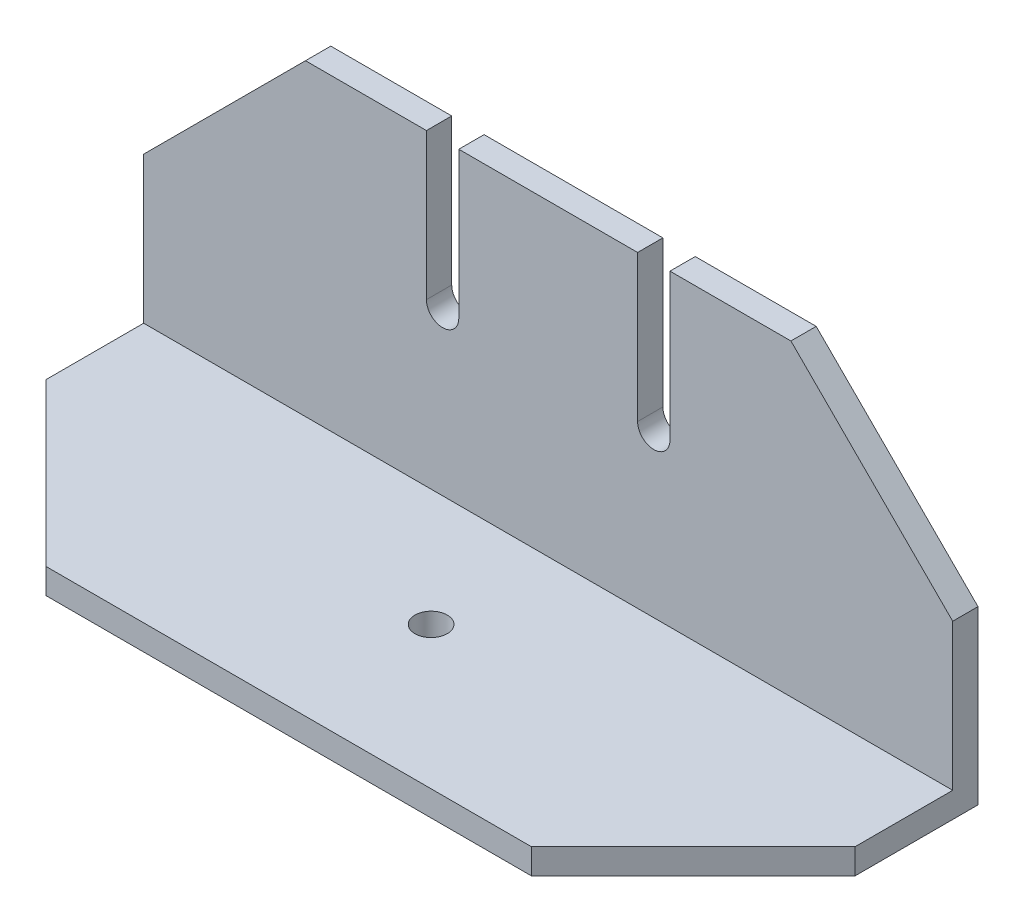
ISO-10303-21;
HEADER;
FILE_DESCRIPTION(('STEP AP214'),'2;1');
FILE_NAME('part.step','',(''),(''),'','','');
FILE_SCHEMA(('AUTOMOTIVE_DESIGN { 1 0 10303 214 1 1 1 1 }'));
ENDSEC;
DATA;
#1=APPLICATION_CONTEXT('core data for automotive mechanical design processes');
#2=APPLICATION_PROTOCOL_DEFINITION('international standard','automotive_design',2000,#1);
#3=PRODUCT_CONTEXT('',#1,'mechanical');
#4=PRODUCT('Part','Part','',(#3));
#5=PRODUCT_RELATED_PRODUCT_CATEGORY('part','',(#4));
#6=PRODUCT_DEFINITION_FORMATION('','',#4);
#7=PRODUCT_DEFINITION_CONTEXT('part definition',#1,'design');
#8=PRODUCT_DEFINITION('design','',#6,#7);
#9=PRODUCT_DEFINITION_SHAPE('','',#8);
#10=(LENGTH_UNIT() NAMED_UNIT(*) SI_UNIT(.MILLI.,.METRE.));
#11=(NAMED_UNIT(*) PLANE_ANGLE_UNIT() SI_UNIT($,.RADIAN.));
#12=(NAMED_UNIT(*) SI_UNIT($,.STERADIAN.) SOLID_ANGLE_UNIT());
#13=UNCERTAINTY_MEASURE_WITH_UNIT(LENGTH_MEASURE(1.E-05),#10,'distance_accuracy_value','');
#14=(GEOMETRIC_REPRESENTATION_CONTEXT(3) GLOBAL_UNCERTAINTY_ASSIGNED_CONTEXT((#13)) GLOBAL_UNIT_ASSIGNED_CONTEXT((#10,
#11,#12)) REPRESENTATION_CONTEXT('',''));
#15=CARTESIAN_POINT('',(0.,0.,0.));
#16=DIRECTION('',(0.,0.,1.));
#17=DIRECTION('',(1.,0.,0.));
#18=AXIS2_PLACEMENT_3D('',#15,#16,#17);
#19=CARTESIAN_POINT('',(100.,38.1,-32.0729965784261));
#20=DIRECTION('',(0.,1.,0.));
#21=DIRECTION('',(0.,0.,1.));
#22=AXIS2_PLACEMENT_3D('',#19,#20,#21);
#23=PLANE('',#22);
#24=DIRECTION('',(-1.,0.,0.));
#25=VECTOR('',#24,1.);
#26=CARTESIAN_POINT('',(100.,38.1,-32.0729965784261));
#27=LINE('',#26,#25);
#28=CARTESIAN_POINT('',(80.,38.1,-32.0729965784261));
#29=VERTEX_POINT('',#28);
#30=CARTESIAN_POINT('',(65.05,38.1,-32.0729965784261));
#31=VERTEX_POINT('',#30);
#32=EDGE_CURVE('E241',#29,#31,#27,.T.);
#33=ORIENTED_EDGE('',*,*,#32,.F.);
#34=DIRECTION('',(0.,0.,-1.));
#35=VECTOR('',#34,1.);
#36=CARTESIAN_POINT('',(80.,38.1,-35.1979965784261));
#37=LINE('',#36,#35);
#38=CARTESIAN_POINT('',(80.,38.1,-35.1979965784261));
#39=VERTEX_POINT('',#38);
#40=EDGE_CURVE('E273',#29,#39,#37,.T.);
#41=ORIENTED_EDGE('',*,*,#40,.T.);
#42=DIRECTION('',(-1.,0.,0.));
#43=VECTOR('',#42,1.);
#44=CARTESIAN_POINT('',(100.,38.1,-35.1979965784261));
#45=LINE('',#44,#43);
#46=CARTESIAN_POINT('',(65.05,38.1,-35.1979965784261));
#47=VERTEX_POINT('',#46);
#48=EDGE_CURVE('E245',#39,#47,#45,.T.);
#49=ORIENTED_EDGE('',*,*,#48,.T.);
#50=DIRECTION('',(0.,0.,-1.));
#51=VECTOR('',#50,1.);
#52=CARTESIAN_POINT('',(65.05,38.1,0.));
#53=LINE('',#52,#51);
#54=EDGE_CURVE('E190',#31,#47,#53,.T.);
#55=ORIENTED_EDGE('',*,*,#54,.F.);
#56=EDGE_LOOP('',(#33,#41,#49,#55));
#57=FACE_BOUND('',#56,.T.);
#58=ADVANCED_FACE('F32',(#57),#23,.T.);
#59=DIRECTION('',(0.,0.,-1.));
#60=VECTOR('',#59,1.);
#61=CARTESIAN_POINT('',(61.05,38.1,0.));
#62=LINE('',#61,#60);
#63=CARTESIAN_POINT('',(61.05,38.1,-32.0729965784261));
#64=VERTEX_POINT('',#63);
#65=CARTESIAN_POINT('',(61.05,38.1,-35.1979965784261));
#66=VERTEX_POINT('',#65);
#67=EDGE_CURVE('E167',#64,#66,#62,.T.);
#68=ORIENTED_EDGE('',*,*,#67,.T.);
#69=CARTESIAN_POINT('',(38.95,38.1,-35.1979965784261));
#70=VERTEX_POINT('',#69);
#71=EDGE_CURVE('E183',#66,#70,#45,.T.);
#72=ORIENTED_EDGE('',*,*,#71,.T.);
#73=DIRECTION('',(0.,0.,-1.));
#74=VECTOR('',#73,1.);
#75=CARTESIAN_POINT('',(38.95,38.1,0.));
#76=LINE('',#75,#74);
#77=CARTESIAN_POINT('',(38.95,38.1,-32.0729965784261));
#78=VERTEX_POINT('',#77);
#79=EDGE_CURVE('E205',#78,#70,#76,.T.);
#80=ORIENTED_EDGE('',*,*,#79,.F.);
#81=EDGE_CURVE('E244',#64,#78,#27,.T.);
#82=ORIENTED_EDGE('',*,*,#81,.F.);
#83=EDGE_LOOP('',(#68,#72,#80,#82));
#84=FACE_BOUND('',#83,.T.);
#85=ADVANCED_FACE('F334',(#84),#23,.T.);
#86=CARTESIAN_POINT('',(100.,0.,-35.1979965784261));
#87=DIRECTION('',(0.,0.,1.));
#88=DIRECTION('',(1.,0.,0.));
#89=AXIS2_PLACEMENT_3D('',#86,#87,#88);
#90=PLANE('',#89);
#91=DIRECTION('',(0.,1.,0.));
#92=VECTOR('',#91,1.);
#93=CARTESIAN_POINT('',(0.,0.,-35.1979965784261));
#94=LINE('',#93,#92);
#95=CARTESIAN_POINT('',(0.,-3.125,-35.1979965784261));
#96=VERTEX_POINT('',#95);
#97=CARTESIAN_POINT('',(0.,18.1,-35.1979965784261));
#98=VERTEX_POINT('',#97);
#99=EDGE_CURVE('E204',#96,#98,#94,.T.);
#100=ORIENTED_EDGE('',*,*,#99,.T.);
#101=DIRECTION('',(-0.707106781186549,-0.707106781186546,0.));
#102=VECTOR('',#101,1.);
#103=CARTESIAN_POINT('',(0.,18.1,-35.1979965784261));
#104=LINE('',#103,#102);
#105=CARTESIAN_POINT('',(20.0000000000001,38.1,-35.1979965784261));
#106=VERTEX_POINT('',#105);
#107=EDGE_CURVE('E265',#98,#106,#104,.F.);
#108=ORIENTED_EDGE('',*,*,#107,.T.);
#109=CARTESIAN_POINT('',(34.95,38.1,-35.1979965784261));
#110=VERTEX_POINT('',#109);
#111=EDGE_CURVE('E243',#110,#106,#45,.T.);
#112=ORIENTED_EDGE('',*,*,#111,.F.);
#113=DIRECTION('',(0.,1.,0.));
#114=VECTOR('',#113,1.);
#115=CARTESIAN_POINT('',(34.95,38.1,-35.1979965784261));
#116=LINE('',#115,#114);
#117=CARTESIAN_POINT('',(34.95,20.,-35.1979965784261));
#118=VERTEX_POINT('',#117);
#119=EDGE_CURVE('E196',#118,#110,#116,.T.);
#120=ORIENTED_EDGE('',*,*,#119,.F.);
#121=CARTESIAN_POINT('',(36.95,20.,-35.1979965784261));
#122=DIRECTION('',(0.,0.,-1.));
#123=DIRECTION('',(1.,0.,0.));
#124=AXIS2_PLACEMENT_3D('',#121,#122,#123);
#125=CIRCLE('',#124,2.);
#126=CARTESIAN_POINT('',(38.95,20.,-35.1979965784261));
#127=VERTEX_POINT('',#126);
#128=EDGE_CURVE('E189',#127,#118,#125,.T.);
#129=ORIENTED_EDGE('',*,*,#128,.F.);
#130=DIRECTION('',(0.,-1.,0.));
#131=VECTOR('',#130,1.);
#132=CARTESIAN_POINT('',(38.95,20.,-35.1979965784261));
#133=LINE('',#132,#131);
#134=EDGE_CURVE('E198',#70,#127,#133,.T.);
#135=ORIENTED_EDGE('',*,*,#134,.F.);
#136=ORIENTED_EDGE('',*,*,#71,.F.);
#137=DIRECTION('',(0.,1.,0.));
#138=VECTOR('',#137,1.);
#139=CARTESIAN_POINT('',(61.05,20.,-35.1979965784261));
#140=LINE('',#139,#138);
#141=CARTESIAN_POINT('',(61.05,20.,-35.1979965784261));
#142=VERTEX_POINT('',#141);
#143=EDGE_CURVE('E161',#142,#66,#140,.T.);
#144=ORIENTED_EDGE('',*,*,#143,.F.);
#145=CARTESIAN_POINT('',(63.05,20.,-35.1979965784261));
#146=DIRECTION('',(0.,0.,-1.));
#147=DIRECTION('',(-1.,0.,0.));
#148=AXIS2_PLACEMENT_3D('',#145,#146,#147);
#149=CIRCLE('',#148,2.);
#150=CARTESIAN_POINT('',(65.05,20.,-35.1979965784261));
#151=VERTEX_POINT('',#150);
#152=EDGE_CURVE('E171',#151,#142,#149,.T.);
#153=ORIENTED_EDGE('',*,*,#152,.F.);
#154=DIRECTION('',(0.,-1.,0.));
#155=VECTOR('',#154,1.);
#156=CARTESIAN_POINT('',(65.05,38.1,-35.1979965784261));
#157=LINE('',#156,#155);
#158=EDGE_CURVE('E168',#47,#151,#157,.T.);
#159=ORIENTED_EDGE('',*,*,#158,.F.);
#160=ORIENTED_EDGE('',*,*,#48,.F.);
#161=DIRECTION('',(0.707106781186546,-0.707106781186549,0.));
#162=VECTOR('',#161,1.);
#163=CARTESIAN_POINT('',(80.,38.1,-35.1979965784261));
#164=LINE('',#163,#162);
#165=CARTESIAN_POINT('',(100.,18.0999999999999,-35.1979965784261));
#166=VERTEX_POINT('',#165);
#167=EDGE_CURVE('E263',#39,#166,#164,.T.);
#168=ORIENTED_EDGE('',*,*,#167,.T.);
#169=DIRECTION('',(0.,1.,0.));
#170=VECTOR('',#169,1.);
#171=CARTESIAN_POINT('',(100.,0.,-35.1979965784261));
#172=LINE('',#171,#170);
#173=CARTESIAN_POINT('',(100.,-3.125,-35.1979965784261));
#174=VERTEX_POINT('',#173);
#175=EDGE_CURVE('E220',#174,#166,#172,.T.);
#176=ORIENTED_EDGE('',*,*,#175,.F.);
#177=DIRECTION('',(-1.,0.,0.));
#178=VECTOR('',#177,1.);
#179=CARTESIAN_POINT('',(100.,-3.125,-35.1979965784261));
#180=LINE('',#179,#178);
#181=EDGE_CURVE('E230',#174,#96,#180,.T.);
#182=ORIENTED_EDGE('',*,*,#181,.T.);
#183=EDGE_LOOP('',(#100,#108,#112,#120,#129,#135,#136,#144,#153,#159,#160,#168,#176,#182));
#184=FACE_BOUND('',#183,.T.);
#185=ADVANCED_FACE('F34',(#184),#90,.F.);
#186=ORIENTED_EDGE('',*,*,#111,.T.);
#187=DIRECTION('',(0.,0.,1.));
#188=VECTOR('',#187,1.);
#189=CARTESIAN_POINT('',(20.0000000000001,38.1,-32.0729965784261));
#190=LINE('',#189,#188);
#191=CARTESIAN_POINT('',(20.,38.1,-32.0729965784261));
#192=VERTEX_POINT('',#191);
#193=EDGE_CURVE('E267',#106,#192,#190,.T.);
#194=ORIENTED_EDGE('',*,*,#193,.T.);
#195=CARTESIAN_POINT('',(34.9500000000001,38.1,-32.0729965784261));
#196=VERTEX_POINT('',#195);
#197=EDGE_CURVE('E240',#196,#192,#27,.T.);
#198=ORIENTED_EDGE('',*,*,#197,.F.);
#199=DIRECTION('',(0.,0.,-1.));
#200=VECTOR('',#199,1.);
#201=CARTESIAN_POINT('',(34.95,38.1,0.));
#202=LINE('',#201,#200);
#203=EDGE_CURVE('E208',#196,#110,#202,.T.);
#204=ORIENTED_EDGE('',*,*,#203,.T.);
#205=EDGE_LOOP('',(#186,#194,#198,#204));
#206=FACE_BOUND('',#205,.T.);
#207=ADVANCED_FACE('F347',(#206),#23,.T.);
#208=CARTESIAN_POINT('',(100.,0.,-32.0729965784261));
#209=DIRECTION('',(0.,0.,1.));
#210=DIRECTION('',(1.,0.,0.));
#211=AXIS2_PLACEMENT_3D('',#208,#209,#210);
#212=PLANE('',#211);
#213=ORIENTED_EDGE('',*,*,#197,.T.);
#214=DIRECTION('',(0.707106781186549,0.707106781186546,0.));
#215=VECTOR('',#214,1.);
#216=CARTESIAN_POINT('',(40.9500000000002,59.05,-32.0729965784261));
#217=LINE('',#216,#215);
#218=CARTESIAN_POINT('',(0.,18.1,-32.0729965784261));
#219=VERTEX_POINT('',#218);
#220=EDGE_CURVE('E271',#192,#219,#217,.F.);
#221=ORIENTED_EDGE('',*,*,#220,.T.);
#222=DIRECTION('',(0.,1.,0.));
#223=VECTOR('',#222,1.);
#224=CARTESIAN_POINT('',(0.,0.,-32.0729965784261));
#225=LINE('',#224,#223);
#226=CARTESIAN_POINT('',(0.,0.,-32.0729965784261));
#227=VERTEX_POINT('',#226);
#228=EDGE_CURVE('E213',#227,#219,#225,.T.);
#229=ORIENTED_EDGE('',*,*,#228,.F.);
#230=DIRECTION('',(-1.,0.,0.));
#231=VECTOR('',#230,1.);
#232=CARTESIAN_POINT('',(100.,0.,-32.0729965784261));
#233=LINE('',#232,#231);
#234=CARTESIAN_POINT('',(100.,0.,-32.0729965784261));
#235=VERTEX_POINT('',#234);
#236=EDGE_CURVE('E237',#235,#227,#233,.T.);
#237=ORIENTED_EDGE('',*,*,#236,.F.);
#238=DIRECTION('',(0.,1.,0.));
#239=VECTOR('',#238,1.);
#240=CARTESIAN_POINT('',(100.,0.,-32.0729965784261));
#241=LINE('',#240,#239);
#242=CARTESIAN_POINT('',(100.,18.0999999999999,-32.0729965784261));
#243=VERTEX_POINT('',#242);
#244=EDGE_CURVE('E223',#235,#243,#241,.T.);
#245=ORIENTED_EDGE('',*,*,#244,.T.);
#246=DIRECTION('',(-0.707106781186546,0.707106781186549,0.));
#247=VECTOR('',#246,1.);
#248=CARTESIAN_POINT('',(109.05,9.04999999999993,-32.0729965784261));
#249=LINE('',#248,#247);
#250=EDGE_CURVE('E269',#243,#29,#249,.T.);
#251=ORIENTED_EDGE('',*,*,#250,.T.);
#252=ORIENTED_EDGE('',*,*,#32,.T.);
#253=DIRECTION('',(0.,1.,0.));
#254=VECTOR('',#253,1.);
#255=CARTESIAN_POINT('',(65.05,0.,-32.0729965784261));
#256=LINE('',#255,#254);
#257=CARTESIAN_POINT('',(65.05,20.,-32.0729965784261));
#258=VERTEX_POINT('',#257);
#259=EDGE_CURVE('E257',#258,#31,#256,.T.);
#260=ORIENTED_EDGE('',*,*,#259,.F.);
#261=CARTESIAN_POINT('',(63.05,20.,-32.0729965784261));
#262=DIRECTION('',(0.,0.,1.));
#263=DIRECTION('',(1.,0.,0.));
#264=AXIS2_PLACEMENT_3D('',#261,#262,#263);
#265=CIRCLE('',#264,2.);
#266=CARTESIAN_POINT('',(61.05,20.,-32.0729965784261));
#267=VERTEX_POINT('',#266);
#268=EDGE_CURVE('E255',#267,#258,#265,.T.);
#269=ORIENTED_EDGE('',*,*,#268,.F.);
#270=DIRECTION('',(0.,-1.,0.));
#271=VECTOR('',#270,1.);
#272=CARTESIAN_POINT('',(61.05,0.,-32.0729965784261));
#273=LINE('',#272,#271);
#274=EDGE_CURVE('E164',#64,#267,#273,.T.);
#275=ORIENTED_EDGE('',*,*,#274,.F.);
#276=ORIENTED_EDGE('',*,*,#81,.T.);
#277=DIRECTION('',(0.,1.,0.));
#278=VECTOR('',#277,1.);
#279=CARTESIAN_POINT('',(38.95,0.,-32.0729965784261));
#280=LINE('',#279,#278);
#281=CARTESIAN_POINT('',(38.95,20.,-32.0729965784261));
#282=VERTEX_POINT('',#281);
#283=EDGE_CURVE('E251',#282,#78,#280,.T.);
#284=ORIENTED_EDGE('',*,*,#283,.F.);
#285=CARTESIAN_POINT('',(36.95,20.,-32.0729965784261));
#286=DIRECTION('',(0.,0.,1.));
#287=DIRECTION('',(1.,0.,0.));
#288=AXIS2_PLACEMENT_3D('',#285,#286,#287);
#289=CIRCLE('',#288,2.);
#290=CARTESIAN_POINT('',(34.95,20.,-32.0729965784261));
#291=VERTEX_POINT('',#290);
#292=EDGE_CURVE('E249',#291,#282,#289,.T.);
#293=ORIENTED_EDGE('',*,*,#292,.F.);
#294=DIRECTION('',(0.,-1.,0.));
#295=VECTOR('',#294,1.);
#296=CARTESIAN_POINT('',(34.95,0.,-32.0729965784261));
#297=LINE('',#296,#295);
#298=EDGE_CURVE('E247',#196,#291,#297,.T.);
#299=ORIENTED_EDGE('',*,*,#298,.F.);
#300=EDGE_LOOP('',(#213,#221,#229,#237,#245,#251,#252,#260,#269,#275,#276,#284,#293,#299));
#301=FACE_BOUND('',#300,.T.);
#302=ADVANCED_FACE('F317',(#301),#212,.T.);
#303=CARTESIAN_POINT('',(100.,0.,0.));
#304=DIRECTION('',(0.,1.,0.));
#305=DIRECTION('',(0.,0.,1.));
#306=AXIS2_PLACEMENT_3D('',#303,#304,#305);
#307=PLANE('',#306);
#308=CARTESIAN_POINT('',(50.,0.,-17.598998289213));
#309=DIRECTION('',(0.,1.,0.));
#310=DIRECTION('',(0.,0.,1.));
#311=AXIS2_PLACEMENT_3D('',#308,#309,#310);
#312=CIRCLE('',#311,2.);
#313=CARTESIAN_POINT('',(50.,0.,-15.598998289213));
#314=VERTEX_POINT('',#313);
#315=EDGE_CURVE('E178',#314,#314,#312,.T.);
#316=ORIENTED_EDGE('',*,*,#315,.F.);
#317=EDGE_LOOP('',(#316));
#318=FACE_BOUND('',#317,.T.);
#319=DIRECTION('',(0.,0.,-1.));
#320=VECTOR('',#319,1.);
#321=CARTESIAN_POINT('',(0.,0.,0.));
#322=LINE('',#321,#320);
#323=CARTESIAN_POINT('',(0.,0.,-20.));
#324=VERTEX_POINT('',#323);
#325=EDGE_CURVE('E216',#324,#227,#322,.T.);
#326=ORIENTED_EDGE('',*,*,#325,.F.);
#327=DIRECTION('',(-0.707106781186549,0.,-0.707106781186546));
#328=VECTOR('',#327,1.);
#329=CARTESIAN_POINT('',(60.0000000000002,0.,40.));
#330=LINE('',#329,#328);
#331=CARTESIAN_POINT('',(20.0000000000001,0.,0.));
#332=VERTEX_POINT('',#331);
#333=EDGE_CURVE('E283',#324,#332,#330,.F.);
#334=ORIENTED_EDGE('',*,*,#333,.T.);
#335=DIRECTION('',(-1.,0.,0.));
#336=VECTOR('',#335,1.);
#337=CARTESIAN_POINT('',(100.,0.,0.));
#338=LINE('',#337,#336);
#339=CARTESIAN_POINT('',(80.,0.,0.));
#340=VERTEX_POINT('',#339);
#341=EDGE_CURVE('E235',#340,#332,#338,.T.);
#342=ORIENTED_EDGE('',*,*,#341,.F.);
#343=DIRECTION('',(0.707106781186546,0.,-0.707106781186549));
#344=VECTOR('',#343,1.);
#345=CARTESIAN_POINT('',(90.,0.,-10.));
#346=LINE('',#345,#344);
#347=CARTESIAN_POINT('',(100.,0.,-20.0000000000001));
#348=VERTEX_POINT('',#347);
#349=EDGE_CURVE('E281',#340,#348,#346,.T.);
#350=ORIENTED_EDGE('',*,*,#349,.T.);
#351=DIRECTION('',(0.,0.,-1.));
#352=VECTOR('',#351,1.);
#353=CARTESIAN_POINT('',(100.,0.,0.));
#354=LINE('',#353,#352);
#355=EDGE_CURVE('E226',#348,#235,#354,.T.);
#356=ORIENTED_EDGE('',*,*,#355,.T.);
#357=ORIENTED_EDGE('',*,*,#236,.T.);
#358=EDGE_LOOP('',(#326,#334,#342,#350,#356,#357));
#359=FACE_BOUND('',#358,.T.);
#360=ADVANCED_FACE('F304',(#318,#359),#307,.T.);
#361=CARTESIAN_POINT('',(100.,-3.125,0.));
#362=DIRECTION('',(0.,0.,1.));
#363=DIRECTION('',(1.,0.,0.));
#364=AXIS2_PLACEMENT_3D('',#361,#362,#363);
#365=PLANE('',#364);
#366=ORIENTED_EDGE('',*,*,#341,.T.);
#367=DIRECTION('',(0.,-1.,0.));
#368=VECTOR('',#367,1.);
#369=CARTESIAN_POINT('',(20.0000000000001,-3.125,0.));
#370=LINE('',#369,#368);
#371=CARTESIAN_POINT('',(20.0000000000001,-3.125,0.));
#372=VERTEX_POINT('',#371);
#373=EDGE_CURVE('E53',#332,#372,#370,.T.);
#374=ORIENTED_EDGE('',*,*,#373,.T.);
#375=DIRECTION('',(-1.,0.,0.));
#376=VECTOR('',#375,1.);
#377=CARTESIAN_POINT('',(100.,-3.125,0.));
#378=LINE('',#377,#376);
#379=CARTESIAN_POINT('',(80.,-3.125,0.));
#380=VERTEX_POINT('',#379);
#381=EDGE_CURVE('E233',#380,#372,#378,.T.);
#382=ORIENTED_EDGE('',*,*,#381,.F.);
#383=DIRECTION('',(0.,1.,0.));
#384=VECTOR('',#383,1.);
#385=CARTESIAN_POINT('',(80.,0.,0.));
#386=LINE('',#385,#384);
#387=EDGE_CURVE('E285',#380,#340,#386,.T.);
#388=ORIENTED_EDGE('',*,*,#387,.T.);
#389=EDGE_LOOP('',(#366,#374,#382,#388));
#390=FACE_BOUND('',#389,.T.);
#391=ADVANCED_FACE('F305',(#390),#365,.T.);
#392=CARTESIAN_POINT('',(100.,-3.125,0.));
#393=DIRECTION('',(0.,1.,0.));
#394=DIRECTION('',(0.,0.,1.));
#395=AXIS2_PLACEMENT_3D('',#392,#393,#394);
#396=PLANE('',#395);
#397=CARTESIAN_POINT('',(50.,-3.125,-17.598998289213));
#398=DIRECTION('',(0.,-1.,0.));
#399=DIRECTION('',(0.,0.,-1.));
#400=AXIS2_PLACEMENT_3D('',#397,#398,#399);
#401=CIRCLE('',#400,2.);
#402=CARTESIAN_POINT('',(50.,-3.125,-19.5989982892131));
#403=VERTEX_POINT('',#402);
#404=EDGE_CURVE('E519',#403,#403,#401,.T.);
#405=ORIENTED_EDGE('',*,*,#404,.F.);
#406=EDGE_LOOP('',(#405));
#407=FACE_BOUND('',#406,.T.);
#408=ORIENTED_EDGE('',*,*,#381,.T.);
#409=DIRECTION('',(0.707106781186549,0.,0.707106781186546));
#410=VECTOR('',#409,1.);
#411=CARTESIAN_POINT('',(0.,-3.125,-20.));
#412=LINE('',#411,#410);
#413=CARTESIAN_POINT('',(0.,-3.125,-20.));
#414=VERTEX_POINT('',#413);
#415=EDGE_CURVE('E40',#372,#414,#412,.F.);
#416=ORIENTED_EDGE('',*,*,#415,.T.);
#417=DIRECTION('',(0.,0.,-1.));
#418=VECTOR('',#417,1.);
#419=CARTESIAN_POINT('',(0.,-3.125,0.));
#420=LINE('',#419,#418);
#421=EDGE_CURVE('E218',#414,#96,#420,.T.);
#422=ORIENTED_EDGE('',*,*,#421,.T.);
#423=ORIENTED_EDGE('',*,*,#181,.F.);
#424=DIRECTION('',(0.,0.,-1.));
#425=VECTOR('',#424,1.);
#426=CARTESIAN_POINT('',(100.,-3.125,0.));
#427=LINE('',#426,#425);
#428=CARTESIAN_POINT('',(100.,-3.125,-20.0000000000001));
#429=VERTEX_POINT('',#428);
#430=EDGE_CURVE('E228',#429,#174,#427,.T.);
#431=ORIENTED_EDGE('',*,*,#430,.F.);
#432=DIRECTION('',(-0.707106781186546,0.,0.707106781186549));
#433=VECTOR('',#432,1.);
#434=CARTESIAN_POINT('',(80.,-3.125,0.));
#435=LINE('',#434,#433);
#436=EDGE_CURVE('E289',#429,#380,#435,.T.);
#437=ORIENTED_EDGE('',*,*,#436,.T.);
#438=EDGE_LOOP('',(#408,#416,#422,#423,#431,#437));
#439=FACE_BOUND('',#438,.T.);
#440=ADVANCED_FACE('F293',(#407,#439),#396,.F.);
#441=CARTESIAN_POINT('',(100.,0.,-35.1979965784261));
#442=DIRECTION('',(-1.,0.,0.));
#443=DIRECTION('',(0.,0.,1.));
#444=AXIS2_PLACEMENT_3D('',#441,#442,#443);
#445=PLANE('',#444);
#446=ORIENTED_EDGE('',*,*,#355,.F.);
#447=DIRECTION('',(0.,-1.,0.));
#448=VECTOR('',#447,1.);
#449=CARTESIAN_POINT('',(100.,-3.125,-20.0000000000001));
#450=LINE('',#449,#448);
#451=EDGE_CURVE('E11',#348,#429,#450,.T.);
#452=ORIENTED_EDGE('',*,*,#451,.T.);
#453=ORIENTED_EDGE('',*,*,#430,.T.);
#454=ORIENTED_EDGE('',*,*,#175,.T.);
#455=DIRECTION('',(0.,0.,1.));
#456=VECTOR('',#455,1.);
#457=CARTESIAN_POINT('',(100.,18.0999999999999,-32.072996578426));
#458=LINE('',#457,#456);
#459=EDGE_CURVE('E276',#166,#243,#458,.T.);
#460=ORIENTED_EDGE('',*,*,#459,.T.);
#461=ORIENTED_EDGE('',*,*,#244,.F.);
#462=EDGE_LOOP('',(#446,#452,#453,#454,#460,#461));
#463=FACE_BOUND('',#462,.T.);
#464=ADVANCED_FACE('F312',(#463),#445,.F.);
#465=CARTESIAN_POINT('',(0.,0.,-35.1979965784261));
#466=DIRECTION('',(-1.,0.,0.));
#467=DIRECTION('',(0.,0.,1.));
#468=AXIS2_PLACEMENT_3D('',#465,#466,#467);
#469=PLANE('',#468);
#470=ORIENTED_EDGE('',*,*,#421,.F.);
#471=DIRECTION('',(0.,1.,0.));
#472=VECTOR('',#471,1.);
#473=CARTESIAN_POINT('',(0.,0.,-20.));
#474=LINE('',#473,#472);
#475=EDGE_CURVE('E278',#414,#324,#474,.T.);
#476=ORIENTED_EDGE('',*,*,#475,.T.);
#477=ORIENTED_EDGE('',*,*,#325,.T.);
#478=ORIENTED_EDGE('',*,*,#228,.T.);
#479=DIRECTION('',(0.,0.,-1.));
#480=VECTOR('',#479,1.);
#481=CARTESIAN_POINT('',(0.,18.1,-35.1979965784262));
#482=LINE('',#481,#480);
#483=EDGE_CURVE('E260',#219,#98,#482,.T.);
#484=ORIENTED_EDGE('',*,*,#483,.T.);
#485=ORIENTED_EDGE('',*,*,#99,.F.);
#486=EDGE_LOOP('',(#470,#476,#477,#478,#484,#485));
#487=FACE_BOUND('',#486,.T.);
#488=ADVANCED_FACE('F299',(#487),#469,.T.);
#489=CARTESIAN_POINT('',(36.95,20.,0.));
#490=DIRECTION('',(0.,0.,-1.));
#491=DIRECTION('',(-1.,0.,0.));
#492=AXIS2_PLACEMENT_3D('',#489,#490,#491);
#493=CYLINDRICAL_SURFACE('',#492,2.);
#494=ORIENTED_EDGE('',*,*,#292,.T.);
#495=DIRECTION('',(0.,0.,-1.));
#496=VECTOR('',#495,1.);
#497=CARTESIAN_POINT('',(38.95,20.,0.));
#498=LINE('',#497,#496);
#499=EDGE_CURVE('E202',#282,#127,#498,.T.);
#500=ORIENTED_EDGE('',*,*,#499,.T.);
#501=ORIENTED_EDGE('',*,*,#128,.T.);
#502=DIRECTION('',(0.,0.,-1.));
#503=VECTOR('',#502,1.);
#504=CARTESIAN_POINT('',(34.95,20.,0.));
#505=LINE('',#504,#503);
#506=EDGE_CURVE('E201',#291,#118,#505,.T.);
#507=ORIENTED_EDGE('',*,*,#506,.F.);
#508=EDGE_LOOP('',(#494,#500,#501,#507));
#509=FACE_BOUND('',#508,.T.);
#510=ADVANCED_FACE('F354',(#509),#493,.F.);
#511=CARTESIAN_POINT('',(38.95,20.,0.));
#512=DIRECTION('',(1.,0.,0.));
#513=DIRECTION('',(0.,1.,0.));
#514=AXIS2_PLACEMENT_3D('',#511,#512,#513);
#515=PLANE('',#514);
#516=ORIENTED_EDGE('',*,*,#283,.T.);
#517=ORIENTED_EDGE('',*,*,#79,.T.);
#518=ORIENTED_EDGE('',*,*,#134,.T.);
#519=ORIENTED_EDGE('',*,*,#499,.F.);
#520=EDGE_LOOP('',(#516,#517,#518,#519));
#521=FACE_BOUND('',#520,.T.);
#522=ADVANCED_FACE('F349',(#521),#515,.F.);
#523=CARTESIAN_POINT('',(34.95,38.1,0.));
#524=DIRECTION('',(-1.,0.,0.));
#525=DIRECTION('',(0.,0.,1.));
#526=AXIS2_PLACEMENT_3D('',#523,#524,#525);
#527=PLANE('',#526);
#528=ORIENTED_EDGE('',*,*,#298,.T.);
#529=ORIENTED_EDGE('',*,*,#506,.T.);
#530=ORIENTED_EDGE('',*,*,#119,.T.);
#531=ORIENTED_EDGE('',*,*,#203,.F.);
#532=EDGE_LOOP('',(#528,#529,#530,#531));
#533=FACE_BOUND('',#532,.T.);
#534=ADVANCED_FACE('F356',(#533),#527,.F.);
#535=CARTESIAN_POINT('',(63.05,20.,0.));
#536=DIRECTION('',(0.,0.,-1.));
#537=DIRECTION('',(-1.,0.,0.));
#538=AXIS2_PLACEMENT_3D('',#535,#536,#537);
#539=CYLINDRICAL_SURFACE('',#538,2.);
#540=ORIENTED_EDGE('',*,*,#268,.T.);
#541=DIRECTION('',(0.,0.,-1.));
#542=VECTOR('',#541,1.);
#543=CARTESIAN_POINT('',(65.05,20.,0.));
#544=LINE('',#543,#542);
#545=EDGE_CURVE('E174',#258,#151,#544,.T.);
#546=ORIENTED_EDGE('',*,*,#545,.T.);
#547=ORIENTED_EDGE('',*,*,#152,.T.);
#548=DIRECTION('',(0.,0.,-1.));
#549=VECTOR('',#548,1.);
#550=CARTESIAN_POINT('',(61.05,20.,0.));
#551=LINE('',#550,#549);
#552=EDGE_CURVE('E157',#267,#142,#551,.T.);
#553=ORIENTED_EDGE('',*,*,#552,.F.);
#554=EDGE_LOOP('',(#540,#546,#547,#553));
#555=FACE_BOUND('',#554,.T.);
#556=ADVANCED_FACE('F172',(#555),#539,.F.);
#557=CARTESIAN_POINT('',(65.05,38.1,0.));
#558=DIRECTION('',(1.,0.,0.));
#559=DIRECTION('',(0.,0.,-1.));
#560=AXIS2_PLACEMENT_3D('',#557,#558,#559);
#561=PLANE('',#560);
#562=ORIENTED_EDGE('',*,*,#259,.T.);
#563=ORIENTED_EDGE('',*,*,#54,.T.);
#564=ORIENTED_EDGE('',*,*,#158,.T.);
#565=ORIENTED_EDGE('',*,*,#545,.F.);
#566=EDGE_LOOP('',(#562,#563,#564,#565));
#567=FACE_BOUND('',#566,.T.);
#568=ADVANCED_FACE('F328',(#567),#561,.F.);
#569=CARTESIAN_POINT('',(61.05,20.,0.));
#570=DIRECTION('',(-1.,0.,0.));
#571=DIRECTION('',(0.,-1.,0.));
#572=AXIS2_PLACEMENT_3D('',#569,#570,#571);
#573=PLANE('',#572);
#574=ORIENTED_EDGE('',*,*,#274,.T.);
#575=ORIENTED_EDGE('',*,*,#552,.T.);
#576=ORIENTED_EDGE('',*,*,#143,.T.);
#577=ORIENTED_EDGE('',*,*,#67,.F.);
#578=EDGE_LOOP('',(#574,#575,#576,#577));
#579=FACE_BOUND('',#578,.T.);
#580=ADVANCED_FACE('F159',(#579),#573,.F.);
#581=CARTESIAN_POINT('',(0.,18.1,-35.1979965784262));
#582=DIRECTION('',(0.707106781186546,-0.707106781186549,0.));
#583=DIRECTION('',(0.707106781186549,0.707106781186546,0.));
#584=AXIS2_PLACEMENT_3D('',#581,#582,#583);
#585=PLANE('',#584);
#586=ORIENTED_EDGE('',*,*,#220,.F.);
#587=ORIENTED_EDGE('',*,*,#193,.F.);
#588=ORIENTED_EDGE('',*,*,#107,.F.);
#589=ORIENTED_EDGE('',*,*,#483,.F.);
#590=EDGE_LOOP('',(#586,#587,#588,#589));
#591=FACE_BOUND('',#590,.T.);
#592=ADVANCED_FACE('F343',(#591),#585,.F.);
#593=CARTESIAN_POINT('',(80.,38.1,-32.0729965784261));
#594=DIRECTION('',(0.707106781186548,0.707106781186546,0.));
#595=DIRECTION('',(-0.707106781186546,0.707106781186549,0.));
#596=AXIS2_PLACEMENT_3D('',#593,#594,#595);
#597=PLANE('',#596);
#598=ORIENTED_EDGE('',*,*,#250,.F.);
#599=ORIENTED_EDGE('',*,*,#459,.F.);
#600=ORIENTED_EDGE('',*,*,#167,.F.);
#601=ORIENTED_EDGE('',*,*,#40,.F.);
#602=EDGE_LOOP('',(#598,#599,#600,#601));
#603=FACE_BOUND('',#602,.T.);
#604=ADVANCED_FACE('F322',(#603),#597,.T.);
#605=CARTESIAN_POINT('',(0.,0.,-20.));
#606=DIRECTION('',(0.707106781186546,0.,-0.707106781186549));
#607=DIRECTION('',(-0.707106781186549,0.,-0.707106781186546));
#608=AXIS2_PLACEMENT_3D('',#605,#606,#607);
#609=PLANE('',#608);
#610=ORIENTED_EDGE('',*,*,#415,.F.);
#611=ORIENTED_EDGE('',*,*,#373,.F.);
#612=ORIENTED_EDGE('',*,*,#333,.F.);
#613=ORIENTED_EDGE('',*,*,#475,.F.);
#614=EDGE_LOOP('',(#610,#611,#612,#613));
#615=FACE_BOUND('',#614,.T.);
#616=ADVANCED_FACE('F301',(#615),#609,.F.);
#617=CARTESIAN_POINT('',(80.,-3.125,0.));
#618=DIRECTION('',(0.707106781186549,0.,0.707106781186546));
#619=DIRECTION('',(0.707106781186546,0.,-0.707106781186549));
#620=AXIS2_PLACEMENT_3D('',#617,#618,#619);
#621=PLANE('',#620);
#622=ORIENTED_EDGE('',*,*,#436,.F.);
#623=ORIENTED_EDGE('',*,*,#451,.F.);
#624=ORIENTED_EDGE('',*,*,#349,.F.);
#625=ORIENTED_EDGE('',*,*,#387,.F.);
#626=EDGE_LOOP('',(#622,#623,#624,#625));
#627=FACE_BOUND('',#626,.T.);
#628=ADVANCED_FACE('F309',(#627),#621,.T.);
#629=CARTESIAN_POINT('',(50.,38.1,-17.598998289213));
#630=DIRECTION('',(0.,-1.,0.));
#631=DIRECTION('',(0.,0.,-1.));
#632=AXIS2_PLACEMENT_3D('',#629,#630,#631);
#633=CYLINDRICAL_SURFACE('',#632,2.);
#634=ORIENTED_EDGE('',*,*,#315,.T.);
#635=EDGE_LOOP('',(#634));
#636=FACE_BOUND('',#635,.T.);
#637=ORIENTED_EDGE('',*,*,#404,.T.);
#638=EDGE_LOOP('',(#637));
#639=FACE_BOUND('',#638,.T.);
#640=ADVANCED_FACE('F456',(#636,#639),#633,.F.);
#641=CLOSED_SHELL('',(#58,#85,#185,#207,#302,#360,#391,#440,#464,#488,#510,#522,#534,#556,#568,
#580,#592,#604,#616,#628,#640));
#642=MANIFOLD_SOLID_BREP('B2',#641);
#643=ADVANCED_BREP_SHAPE_REPRESENTATION('',(#18,#642),#14);
#644=SHAPE_DEFINITION_REPRESENTATION(#9,#643);
ENDSEC;
END-ISO-10303-21;
